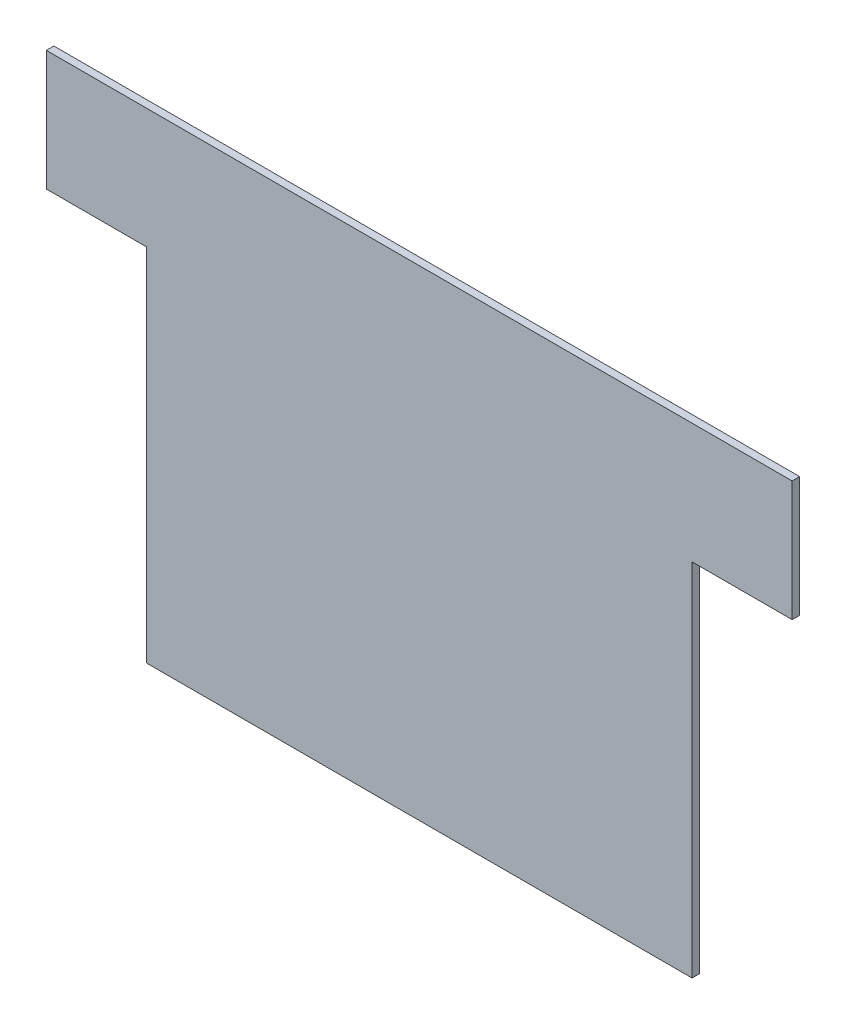
ISO-10303-21;
HEADER;
FILE_DESCRIPTION(('STEP AP214'),'2;1');
FILE_NAME('part.step','',(''),(''),'','','');
FILE_SCHEMA(('AUTOMOTIVE_DESIGN { 1 0 10303 214 1 1 1 1 }'));
ENDSEC;
DATA;
#1=APPLICATION_CONTEXT('core data for automotive mechanical design processes');
#2=APPLICATION_PROTOCOL_DEFINITION('international standard','automotive_design',2000,#1);
#3=PRODUCT_CONTEXT('',#1,'mechanical');
#4=PRODUCT('Part','Part','',(#3));
#5=PRODUCT_RELATED_PRODUCT_CATEGORY('part','',(#4));
#6=PRODUCT_DEFINITION_FORMATION('','',#4);
#7=PRODUCT_DEFINITION_CONTEXT('part definition',#1,'design');
#8=PRODUCT_DEFINITION('design','',#6,#7);
#9=PRODUCT_DEFINITION_SHAPE('','',#8);
#10=(LENGTH_UNIT() NAMED_UNIT(*) SI_UNIT(.MILLI.,.METRE.));
#11=(NAMED_UNIT(*) PLANE_ANGLE_UNIT() SI_UNIT($,.RADIAN.));
#12=(NAMED_UNIT(*) SI_UNIT($,.STERADIAN.) SOLID_ANGLE_UNIT());
#13=UNCERTAINTY_MEASURE_WITH_UNIT(LENGTH_MEASURE(1.E-05),#10,'distance_accuracy_value','');
#14=(GEOMETRIC_REPRESENTATION_CONTEXT(3) GLOBAL_UNCERTAINTY_ASSIGNED_CONTEXT((#13)) GLOBAL_UNIT_ASSIGNED_CONTEXT((#10,
#11,#12)) REPRESENTATION_CONTEXT('',''));
#15=CARTESIAN_POINT('',(0.,0.,0.));
#16=DIRECTION('',(0.,0.,1.));
#17=DIRECTION('',(1.,0.,0.));
#18=AXIS2_PLACEMENT_3D('',#15,#16,#17);
#19=CARTESIAN_POINT('',(0.,0.,4.7625));
#20=DIRECTION('',(1.,0.,0.));
#21=DIRECTION('',(0.,0.,-1.));
#22=AXIS2_PLACEMENT_3D('',#19,#20,#21);
#23=PLANE('',#22);
#24=DIRECTION('',(0.,-1.,0.));
#25=VECTOR('',#24,1.);
#26=CARTESIAN_POINT('',(0.,0.,0.));
#27=LINE('',#26,#25);
#28=CARTESIAN_POINT('',(0.,228.6,0.));
#29=VERTEX_POINT('',#28);
#30=CARTESIAN_POINT('',(0.,0.,0.));
#31=VERTEX_POINT('',#30);
#32=EDGE_CURVE('E129',#29,#31,#27,.T.);
#33=ORIENTED_EDGE('',*,*,#32,.T.);
#34=DIRECTION('',(0.,0.,-1.));
#35=VECTOR('',#34,1.);
#36=CARTESIAN_POINT('',(0.,0.,4.7625));
#37=LINE('',#36,#35);
#38=CARTESIAN_POINT('',(0.,0.,4.7625));
#39=VERTEX_POINT('',#38);
#40=EDGE_CURVE('E11',#39,#31,#37,.T.);
#41=ORIENTED_EDGE('',*,*,#40,.F.);
#42=DIRECTION('',(0.,-1.,0.));
#43=VECTOR('',#42,1.);
#44=CARTESIAN_POINT('',(0.,0.,4.7625));
#45=LINE('',#44,#43);
#46=CARTESIAN_POINT('',(0.,228.6,4.7625));
#47=VERTEX_POINT('',#46);
#48=EDGE_CURVE('E143',#47,#39,#45,.T.);
#49=ORIENTED_EDGE('',*,*,#48,.F.);
#50=DIRECTION('',(0.,0.,-1.));
#51=VECTOR('',#50,1.);
#52=CARTESIAN_POINT('',(0.,228.6,4.7625));
#53=LINE('',#52,#51);
#54=EDGE_CURVE('E125',#47,#29,#53,.T.);
#55=ORIENTED_EDGE('',*,*,#54,.T.);
#56=EDGE_LOOP('',(#33,#41,#49,#55));
#57=FACE_BOUND('',#56,.T.);
#58=ADVANCED_FACE('F33',(#57),#23,.F.);
#59=CARTESIAN_POINT('',(0.,0.,4.7625));
#60=DIRECTION('',(0.,1.,0.));
#61=DIRECTION('',(0.,0.,1.));
#62=AXIS2_PLACEMENT_3D('',#59,#60,#61);
#63=PLANE('',#62);
#64=DIRECTION('',(1.,0.,0.));
#65=VECTOR('',#64,1.);
#66=CARTESIAN_POINT('',(0.,0.,0.));
#67=LINE('',#66,#65);
#68=CARTESIAN_POINT('',(346.075,0.,0.));
#69=VERTEX_POINT('',#68);
#70=EDGE_CURVE('E132',#31,#69,#67,.T.);
#71=ORIENTED_EDGE('',*,*,#70,.T.);
#72=DIRECTION('',(0.,0.,-1.));
#73=VECTOR('',#72,1.);
#74=CARTESIAN_POINT('',(346.075,0.,4.7625));
#75=LINE('',#74,#73);
#76=CARTESIAN_POINT('',(346.075,0.,4.7625));
#77=VERTEX_POINT('',#76);
#78=EDGE_CURVE('E41',#77,#69,#75,.T.);
#79=ORIENTED_EDGE('',*,*,#78,.F.);
#80=DIRECTION('',(1.,0.,0.));
#81=VECTOR('',#80,1.);
#82=CARTESIAN_POINT('',(0.,0.,4.7625));
#83=LINE('',#82,#81);
#84=EDGE_CURVE('E92',#39,#77,#83,.T.);
#85=ORIENTED_EDGE('',*,*,#84,.F.);
#86=ORIENTED_EDGE('',*,*,#40,.T.);
#87=EDGE_LOOP('',(#71,#79,#85,#86));
#88=FACE_BOUND('',#87,.T.);
#89=ADVANCED_FACE('F178',(#88),#63,.F.);
#90=CARTESIAN_POINT('',(346.075,0.,4.7625));
#91=DIRECTION('',(-1.,0.,0.));
#92=DIRECTION('',(0.,0.,1.));
#93=AXIS2_PLACEMENT_3D('',#90,#91,#92);
#94=PLANE('',#93);
#95=DIRECTION('',(0.,1.,0.));
#96=VECTOR('',#95,1.);
#97=CARTESIAN_POINT('',(346.075,0.,0.));
#98=LINE('',#97,#96);
#99=CARTESIAN_POINT('',(346.075,228.6,0.));
#100=VERTEX_POINT('',#99);
#101=EDGE_CURVE('E134',#69,#100,#98,.T.);
#102=ORIENTED_EDGE('',*,*,#101,.T.);
#103=DIRECTION('',(0.,0.,-1.));
#104=VECTOR('',#103,1.);
#105=CARTESIAN_POINT('',(346.075,228.6,4.7625));
#106=LINE('',#105,#104);
#107=CARTESIAN_POINT('',(346.075,228.6,4.7625));
#108=VERTEX_POINT('',#107);
#109=EDGE_CURVE('E150',#108,#100,#106,.T.);
#110=ORIENTED_EDGE('',*,*,#109,.F.);
#111=DIRECTION('',(0.,1.,0.));
#112=VECTOR('',#111,1.);
#113=CARTESIAN_POINT('',(346.075,0.,4.7625));
#114=LINE('',#113,#112);
#115=EDGE_CURVE('E158',#77,#108,#114,.T.);
#116=ORIENTED_EDGE('',*,*,#115,.F.);
#117=ORIENTED_EDGE('',*,*,#78,.T.);
#118=EDGE_LOOP('',(#102,#110,#116,#117));
#119=FACE_BOUND('',#118,.T.);
#120=ADVANCED_FACE('F156',(#119),#94,.F.);
#121=CARTESIAN_POINT('',(346.075,228.6,4.7625));
#122=DIRECTION('',(0.,1.,0.));
#123=DIRECTION('',(0.,0.,1.));
#124=AXIS2_PLACEMENT_3D('',#121,#122,#123);
#125=PLANE('',#124);
#126=DIRECTION('',(1.,0.,0.));
#127=VECTOR('',#126,1.);
#128=CARTESIAN_POINT('',(346.075,228.6,0.));
#129=LINE('',#128,#127);
#130=CARTESIAN_POINT('',(409.575,228.6,0.));
#131=VERTEX_POINT('',#130);
#132=EDGE_CURVE('E136',#100,#131,#129,.T.);
#133=ORIENTED_EDGE('',*,*,#132,.T.);
#134=DIRECTION('',(0.,0.,-1.));
#135=VECTOR('',#134,1.);
#136=CARTESIAN_POINT('',(409.575,228.6,4.7625));
#137=LINE('',#136,#135);
#138=CARTESIAN_POINT('',(409.575,228.6,4.7625));
#139=VERTEX_POINT('',#138);
#140=EDGE_CURVE('E147',#139,#131,#137,.T.);
#141=ORIENTED_EDGE('',*,*,#140,.F.);
#142=DIRECTION('',(1.,0.,0.));
#143=VECTOR('',#142,1.);
#144=CARTESIAN_POINT('',(346.075,228.6,4.7625));
#145=LINE('',#144,#143);
#146=EDGE_CURVE('E170',#108,#139,#145,.T.);
#147=ORIENTED_EDGE('',*,*,#146,.F.);
#148=ORIENTED_EDGE('',*,*,#109,.T.);
#149=EDGE_LOOP('',(#133,#141,#147,#148));
#150=FACE_BOUND('',#149,.T.);
#151=ADVANCED_FACE('F166',(#150),#125,.F.);
#152=CARTESIAN_POINT('',(409.575,304.8,4.7625));
#153=DIRECTION('',(-1.,0.,0.));
#154=DIRECTION('',(0.,0.,1.));
#155=AXIS2_PLACEMENT_3D('',#152,#153,#154);
#156=PLANE('',#155);
#157=DIRECTION('',(0.,1.,0.));
#158=VECTOR('',#157,1.);
#159=CARTESIAN_POINT('',(409.575,304.8,0.));
#160=LINE('',#159,#158);
#161=CARTESIAN_POINT('',(409.575,304.8,0.));
#162=VERTEX_POINT('',#161);
#163=EDGE_CURVE('E138',#131,#162,#160,.T.);
#164=ORIENTED_EDGE('',*,*,#163,.T.);
#165=DIRECTION('',(0.,0.,-1.));
#166=VECTOR('',#165,1.);
#167=CARTESIAN_POINT('',(409.575,304.8,4.7625));
#168=LINE('',#167,#166);
#169=CARTESIAN_POINT('',(409.575,304.8,4.7625));
#170=VERTEX_POINT('',#169);
#171=EDGE_CURVE('E120',#170,#162,#168,.T.);
#172=ORIENTED_EDGE('',*,*,#171,.F.);
#173=DIRECTION('',(0.,1.,0.));
#174=VECTOR('',#173,1.);
#175=CARTESIAN_POINT('',(409.575,304.8,4.7625));
#176=LINE('',#175,#174);
#177=EDGE_CURVE('E111',#139,#170,#176,.T.);
#178=ORIENTED_EDGE('',*,*,#177,.F.);
#179=ORIENTED_EDGE('',*,*,#140,.T.);
#180=EDGE_LOOP('',(#164,#172,#178,#179));
#181=FACE_BOUND('',#180,.T.);
#182=ADVANCED_FACE('F169',(#181),#156,.F.);
#183=CARTESIAN_POINT('',(-63.5,304.8,4.7625));
#184=DIRECTION('',(0.,-1.,0.));
#185=DIRECTION('',(0.,0.,-1.));
#186=AXIS2_PLACEMENT_3D('',#183,#184,#185);
#187=PLANE('',#186);
#188=DIRECTION('',(-1.,0.,0.));
#189=VECTOR('',#188,1.);
#190=CARTESIAN_POINT('',(-63.5,304.8,0.));
#191=LINE('',#190,#189);
#192=CARTESIAN_POINT('',(-63.5,304.8,0.));
#193=VERTEX_POINT('',#192);
#194=EDGE_CURVE('E119',#162,#193,#191,.T.);
#195=ORIENTED_EDGE('',*,*,#194,.T.);
#196=DIRECTION('',(0.,0.,-1.));
#197=VECTOR('',#196,1.);
#198=CARTESIAN_POINT('',(-63.5,304.8,4.7625));
#199=LINE('',#198,#197);
#200=CARTESIAN_POINT('',(-63.5,304.8,4.7625));
#201=VERTEX_POINT('',#200);
#202=EDGE_CURVE('E116',#201,#193,#199,.T.);
#203=ORIENTED_EDGE('',*,*,#202,.F.);
#204=DIRECTION('',(-1.,0.,0.));
#205=VECTOR('',#204,1.);
#206=CARTESIAN_POINT('',(-63.5,304.8,4.7625));
#207=LINE('',#206,#205);
#208=EDGE_CURVE('E105',#170,#201,#207,.T.);
#209=ORIENTED_EDGE('',*,*,#208,.F.);
#210=ORIENTED_EDGE('',*,*,#171,.T.);
#211=EDGE_LOOP('',(#195,#203,#209,#210));
#212=FACE_BOUND('',#211,.T.);
#213=ADVANCED_FACE('F117',(#212),#187,.F.);
#214=CARTESIAN_POINT('',(-63.5,304.8,4.7625));
#215=DIRECTION('',(1.,0.,0.));
#216=DIRECTION('',(0.,1.,0.));
#217=AXIS2_PLACEMENT_3D('',#214,#215,#216);
#218=PLANE('',#217);
#219=DIRECTION('',(0.,-1.,0.));
#220=VECTOR('',#219,1.);
#221=CARTESIAN_POINT('',(-63.5,304.8,0.));
#222=LINE('',#221,#220);
#223=CARTESIAN_POINT('',(-63.5,228.6,0.));
#224=VERTEX_POINT('',#223);
#225=EDGE_CURVE('E78',#193,#224,#222,.T.);
#226=ORIENTED_EDGE('',*,*,#225,.T.);
#227=DIRECTION('',(0.,0.,-1.));
#228=VECTOR('',#227,1.);
#229=CARTESIAN_POINT('',(-63.5,228.6,4.7625));
#230=LINE('',#229,#228);
#231=CARTESIAN_POINT('',(-63.5,228.6,4.7625));
#232=VERTEX_POINT('',#231);
#233=EDGE_CURVE('E121',#232,#224,#230,.T.);
#234=ORIENTED_EDGE('',*,*,#233,.F.);
#235=DIRECTION('',(0.,-1.,0.));
#236=VECTOR('',#235,1.);
#237=CARTESIAN_POINT('',(-63.5,304.8,4.7625));
#238=LINE('',#237,#236);
#239=EDGE_CURVE('E109',#201,#232,#238,.T.);
#240=ORIENTED_EDGE('',*,*,#239,.F.);
#241=ORIENTED_EDGE('',*,*,#202,.T.);
#242=EDGE_LOOP('',(#226,#234,#240,#241));
#243=FACE_BOUND('',#242,.T.);
#244=ADVANCED_FACE('F123',(#243),#218,.F.);
#245=CARTESIAN_POINT('',(-63.5,228.6,4.7625));
#246=DIRECTION('',(0.,1.,0.));
#247=DIRECTION('',(0.,0.,1.));
#248=AXIS2_PLACEMENT_3D('',#245,#246,#247);
#249=PLANE('',#248);
#250=DIRECTION('',(1.,0.,0.));
#251=VECTOR('',#250,1.);
#252=CARTESIAN_POINT('',(-63.5,228.6,0.));
#253=LINE('',#252,#251);
#254=EDGE_CURVE('E84',#224,#29,#253,.T.);
#255=ORIENTED_EDGE('',*,*,#254,.T.);
#256=ORIENTED_EDGE('',*,*,#54,.F.);
#257=DIRECTION('',(1.,0.,0.));
#258=VECTOR('',#257,1.);
#259=CARTESIAN_POINT('',(-63.5,228.6,4.7625));
#260=LINE('',#259,#258);
#261=EDGE_CURVE('E49',#232,#47,#260,.T.);
#262=ORIENTED_EDGE('',*,*,#261,.F.);
#263=ORIENTED_EDGE('',*,*,#233,.T.);
#264=EDGE_LOOP('',(#255,#256,#262,#263));
#265=FACE_BOUND('',#264,.T.);
#266=ADVANCED_FACE('F194',(#265),#249,.F.);
#267=CARTESIAN_POINT('',(0.,0.,4.7625));
#268=DIRECTION('',(0.,0.,-1.));
#269=DIRECTION('',(-1.,0.,0.));
#270=AXIS2_PLACEMENT_3D('',#267,#268,#269);
#271=PLANE('',#270);
#272=ORIENTED_EDGE('',*,*,#48,.T.);
#273=ORIENTED_EDGE('',*,*,#84,.T.);
#274=ORIENTED_EDGE('',*,*,#115,.T.);
#275=ORIENTED_EDGE('',*,*,#146,.T.);
#276=ORIENTED_EDGE('',*,*,#177,.T.);
#277=ORIENTED_EDGE('',*,*,#208,.T.);
#278=ORIENTED_EDGE('',*,*,#239,.T.);
#279=ORIENTED_EDGE('',*,*,#261,.T.);
#280=EDGE_LOOP('',(#272,#273,#274,#275,#276,#277,#278,#279));
#281=FACE_BOUND('',#280,.T.);
#282=ADVANCED_FACE('F107',(#281),#271,.F.);
#283=CARTESIAN_POINT('',(0.,0.,0.));
#284=DIRECTION('',(0.,0.,-1.));
#285=DIRECTION('',(-1.,0.,0.));
#286=AXIS2_PLACEMENT_3D('',#283,#284,#285);
#287=PLANE('',#286);
#288=ORIENTED_EDGE('',*,*,#32,.F.);
#289=ORIENTED_EDGE('',*,*,#254,.F.);
#290=ORIENTED_EDGE('',*,*,#225,.F.);
#291=ORIENTED_EDGE('',*,*,#194,.F.);
#292=ORIENTED_EDGE('',*,*,#163,.F.);
#293=ORIENTED_EDGE('',*,*,#132,.F.);
#294=ORIENTED_EDGE('',*,*,#101,.F.);
#295=ORIENTED_EDGE('',*,*,#70,.F.);
#296=EDGE_LOOP('',(#288,#289,#290,#291,#292,#293,#294,#295));
#297=FACE_BOUND('',#296,.T.);
#298=ADVANCED_FACE('F162',(#297),#287,.T.);
#299=CLOSED_SHELL('',(#58,#89,#120,#151,#182,#213,#244,#266,#282,#298));
#300=MANIFOLD_SOLID_BREP('B2',#299);
#301=ADVANCED_BREP_SHAPE_REPRESENTATION('',(#18,#300),#14);
#302=SHAPE_DEFINITION_REPRESENTATION(#9,#301);
ENDSEC;
END-ISO-10303-21;
